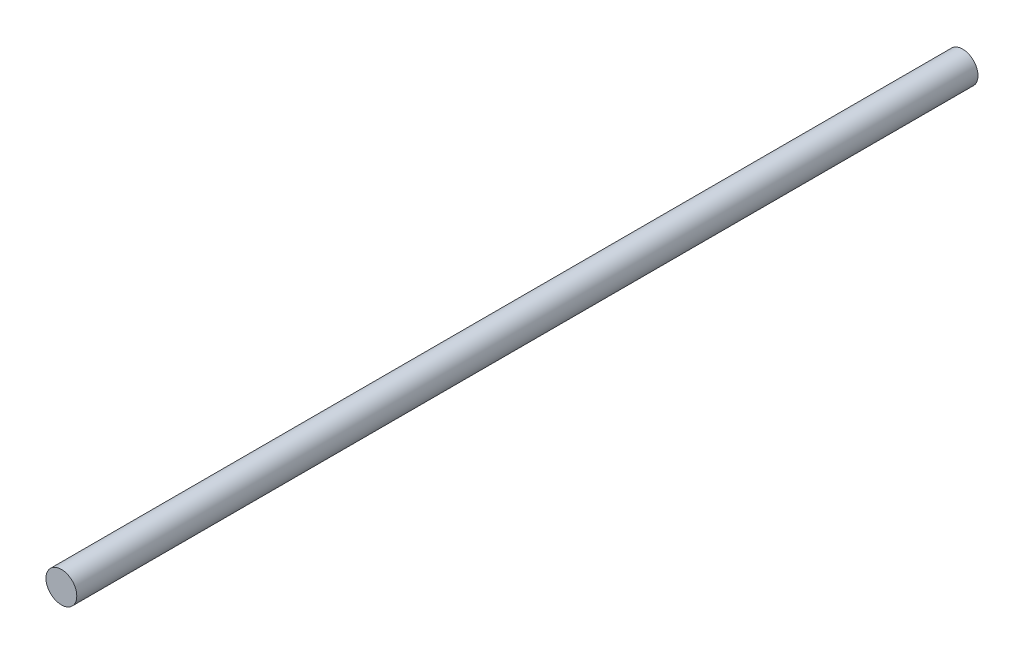
ISO-10303-21;
HEADER;
FILE_DESCRIPTION(('STEP AP214'),'2;1');
FILE_NAME('part.step','',(''),(''),'','','');
FILE_SCHEMA(('AUTOMOTIVE_DESIGN { 1 0 10303 214 1 1 1 1 }'));
ENDSEC;
DATA;
#1=APPLICATION_CONTEXT('core data for automotive mechanical design processes');
#2=APPLICATION_PROTOCOL_DEFINITION('international standard','automotive_design',2000,#1);
#3=PRODUCT_CONTEXT('',#1,'mechanical');
#4=PRODUCT('Part','Part','',(#3));
#5=PRODUCT_RELATED_PRODUCT_CATEGORY('part','',(#4));
#6=PRODUCT_DEFINITION_FORMATION('','',#4);
#7=PRODUCT_DEFINITION_CONTEXT('part definition',#1,'design');
#8=PRODUCT_DEFINITION('design','',#6,#7);
#9=PRODUCT_DEFINITION_SHAPE('','',#8);
#10=(LENGTH_UNIT() NAMED_UNIT(*) SI_UNIT(.MILLI.,.METRE.));
#11=(NAMED_UNIT(*) PLANE_ANGLE_UNIT() SI_UNIT($,.RADIAN.));
#12=(NAMED_UNIT(*) SI_UNIT($,.STERADIAN.) SOLID_ANGLE_UNIT());
#13=UNCERTAINTY_MEASURE_WITH_UNIT(LENGTH_MEASURE(1.E-05),#10,'distance_accuracy_value','');
#14=(GEOMETRIC_REPRESENTATION_CONTEXT(3) GLOBAL_UNCERTAINTY_ASSIGNED_CONTEXT((#13)) GLOBAL_UNIT_ASSIGNED_CONTEXT((#10,
#11,#12)) REPRESENTATION_CONTEXT('',''));
#15=CARTESIAN_POINT('',(0.,0.,0.));
#16=DIRECTION('',(0.,0.,1.));
#17=DIRECTION('',(1.,0.,0.));
#18=AXIS2_PLACEMENT_3D('',#15,#16,#17);
#19=CARTESIAN_POINT('',(-2.22044604925031E-13,6.66133814775094E-13,297.18));
#20=DIRECTION('',(0.,0.,-1.));
#21=DIRECTION('',(-1.,0.,0.));
#22=AXIS2_PLACEMENT_3D('',#19,#20,#21);
#23=CYLINDRICAL_SURFACE('',#22,5.08);
#24=CARTESIAN_POINT('',(-2.22044604925031E-13,6.66133814775094E-13,297.18));
#25=DIRECTION('',(0.,0.,1.));
#26=DIRECTION('',(1.,0.,0.));
#27=AXIS2_PLACEMENT_3D('',#24,#25,#26);
#28=CIRCLE('',#27,5.08);
#29=CARTESIAN_POINT('',(5.07999999999978,6.66133814775094E-13,297.18));
#30=VERTEX_POINT('',#29);
#31=EDGE_CURVE('E10',#30,#30,#28,.T.);
#32=ORIENTED_EDGE('',*,*,#31,.F.);
#33=EDGE_LOOP('',(#32));
#34=FACE_BOUND('',#33,.T.);
#35=CARTESIAN_POINT('',(0.,0.,0.));
#36=DIRECTION('',(0.,0.,1.));
#37=DIRECTION('',(1.,0.,0.));
#38=AXIS2_PLACEMENT_3D('',#35,#36,#37);
#39=CIRCLE('',#38,5.08);
#40=CARTESIAN_POINT('',(5.08,0.,0.));
#41=VERTEX_POINT('',#40);
#42=EDGE_CURVE('E37',#41,#41,#39,.T.);
#43=ORIENTED_EDGE('',*,*,#42,.T.);
#44=EDGE_LOOP('',(#43));
#45=FACE_BOUND('',#44,.T.);
#46=ADVANCED_FACE('F34',(#34,#45),#23,.T.);
#47=CARTESIAN_POINT('',(-2.22044604925031E-13,6.66133814775094E-13,297.18));
#48=DIRECTION('',(0.,0.,1.));
#49=DIRECTION('',(1.,0.,0.));
#50=AXIS2_PLACEMENT_3D('',#47,#48,#49);
#51=PLANE('',#50);
#52=ORIENTED_EDGE('',*,*,#31,.T.);
#53=EDGE_LOOP('',(#52));
#54=FACE_BOUND('',#53,.T.);
#55=ADVANCED_FACE('F49',(#54),#51,.T.);
#56=CARTESIAN_POINT('',(0.,0.,0.));
#57=DIRECTION('',(0.,0.,1.));
#58=DIRECTION('',(1.,0.,0.));
#59=AXIS2_PLACEMENT_3D('',#56,#57,#58);
#60=PLANE('',#59);
#61=ORIENTED_EDGE('',*,*,#42,.F.);
#62=EDGE_LOOP('',(#61));
#63=FACE_BOUND('',#62,.T.);
#64=ADVANCED_FACE('F47',(#63),#60,.F.);
#65=CLOSED_SHELL('',(#46,#55,#64));
#66=MANIFOLD_SOLID_BREP('B2',#65);
#67=ADVANCED_BREP_SHAPE_REPRESENTATION('',(#18,#66),#14);
#68=SHAPE_DEFINITION_REPRESENTATION(#9,#67);
ENDSEC;
END-ISO-10303-21;
